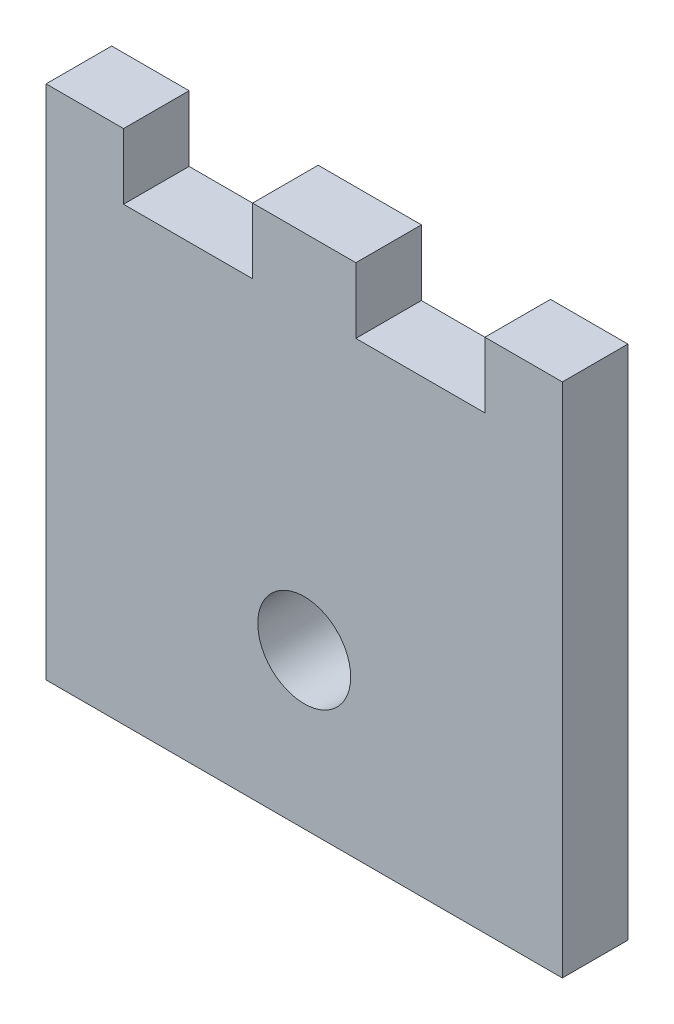
ISO-10303-21;
HEADER;
FILE_DESCRIPTION(('STEP AP214'),'2;1');
FILE_NAME('part.step','',(''),(''),'','','');
FILE_SCHEMA(('AUTOMOTIVE_DESIGN { 1 0 10303 214 1 1 1 1 }'));
ENDSEC;
DATA;
#1=APPLICATION_CONTEXT('core data for automotive mechanical design processes');
#2=APPLICATION_PROTOCOL_DEFINITION('international standard','automotive_design',2000,#1);
#3=PRODUCT_CONTEXT('',#1,'mechanical');
#4=PRODUCT('Part','Part','',(#3));
#5=PRODUCT_RELATED_PRODUCT_CATEGORY('part','',(#4));
#6=PRODUCT_DEFINITION_FORMATION('','',#4);
#7=PRODUCT_DEFINITION_CONTEXT('part definition',#1,'design');
#8=PRODUCT_DEFINITION('design','',#6,#7);
#9=PRODUCT_DEFINITION_SHAPE('','',#8);
#10=(LENGTH_UNIT() NAMED_UNIT(*) SI_UNIT(.MILLI.,.METRE.));
#11=(NAMED_UNIT(*) PLANE_ANGLE_UNIT() SI_UNIT($,.RADIAN.));
#12=(NAMED_UNIT(*) SI_UNIT($,.STERADIAN.) SOLID_ANGLE_UNIT());
#13=UNCERTAINTY_MEASURE_WITH_UNIT(LENGTH_MEASURE(1.E-05),#10,'distance_accuracy_value','');
#14=(GEOMETRIC_REPRESENTATION_CONTEXT(3) GLOBAL_UNCERTAINTY_ASSIGNED_CONTEXT((#13)) GLOBAL_UNIT_ASSIGNED_CONTEXT((#10,
#11,#12)) REPRESENTATION_CONTEXT('',''));
#15=CARTESIAN_POINT('',(0.,0.,0.));
#16=DIRECTION('',(0.,0.,1.));
#17=DIRECTION('',(1.,0.,0.));
#18=AXIS2_PLACEMENT_3D('',#15,#16,#17);
#19=CARTESIAN_POINT('',(0.,50.,6.35));
#20=DIRECTION('',(0.,-1.,0.));
#21=DIRECTION('',(0.,0.,-1.));
#22=AXIS2_PLACEMENT_3D('',#19,#20,#21);
#23=PLANE('',#22);
#24=DIRECTION('',(-1.,0.,0.));
#25=VECTOR('',#24,1.);
#26=CARTESIAN_POINT('',(0.,50.,6.35));
#27=LINE('',#26,#25);
#28=CARTESIAN_POINT('',(7.5,50.,6.35));
#29=VERTEX_POINT('',#28);
#30=CARTESIAN_POINT('',(0.,50.,6.35));
#31=VERTEX_POINT('',#30);
#32=EDGE_CURVE('E229',#29,#31,#27,.T.);
#33=ORIENTED_EDGE('',*,*,#32,.F.);
#34=DIRECTION('',(0.,0.,1.));
#35=VECTOR('',#34,1.);
#36=CARTESIAN_POINT('',(7.5,50.,0.));
#37=LINE('',#36,#35);
#38=CARTESIAN_POINT('',(7.5,50.,0.));
#39=VERTEX_POINT('',#38);
#40=EDGE_CURVE('E167',#39,#29,#37,.T.);
#41=ORIENTED_EDGE('',*,*,#40,.F.);
#42=DIRECTION('',(-1.,0.,0.));
#43=VECTOR('',#42,1.);
#44=CARTESIAN_POINT('',(0.,50.,0.));
#45=LINE('',#44,#43);
#46=CARTESIAN_POINT('',(0.,50.,0.));
#47=VERTEX_POINT('',#46);
#48=EDGE_CURVE('E152',#39,#47,#45,.T.);
#49=ORIENTED_EDGE('',*,*,#48,.T.);
#50=DIRECTION('',(0.,0.,-1.));
#51=VECTOR('',#50,1.);
#52=CARTESIAN_POINT('',(0.,50.,6.35));
#53=LINE('',#52,#51);
#54=EDGE_CURVE('E234',#31,#47,#53,.T.);
#55=ORIENTED_EDGE('',*,*,#54,.F.);
#56=EDGE_LOOP('',(#33,#41,#49,#55));
#57=FACE_BOUND('',#56,.T.);
#58=ADVANCED_FACE('F39',(#57),#23,.F.);
#59=CARTESIAN_POINT('',(30.,50.,0.));
#60=VERTEX_POINT('',#59);
#61=CARTESIAN_POINT('',(20.,50.,0.));
#62=VERTEX_POINT('',#61);
#63=EDGE_CURVE('E248',#60,#62,#45,.T.);
#64=ORIENTED_EDGE('',*,*,#63,.T.);
#65=DIRECTION('',(0.,0.,1.));
#66=VECTOR('',#65,1.);
#67=CARTESIAN_POINT('',(20.,50.,0.));
#68=LINE('',#67,#66);
#69=CARTESIAN_POINT('',(20.,50.,6.35));
#70=VERTEX_POINT('',#69);
#71=EDGE_CURVE('E171',#62,#70,#68,.T.);
#72=ORIENTED_EDGE('',*,*,#71,.T.);
#73=CARTESIAN_POINT('',(30.,50.,6.35));
#74=VERTEX_POINT('',#73);
#75=EDGE_CURVE('E235',#74,#70,#27,.T.);
#76=ORIENTED_EDGE('',*,*,#75,.F.);
#77=DIRECTION('',(0.,0.,1.));
#78=VECTOR('',#77,1.);
#79=CARTESIAN_POINT('',(30.,50.,0.));
#80=LINE('',#79,#78);
#81=EDGE_CURVE('E164',#60,#74,#80,.T.);
#82=ORIENTED_EDGE('',*,*,#81,.F.);
#83=EDGE_LOOP('',(#64,#72,#76,#82));
#84=FACE_BOUND('',#83,.T.);
#85=ADVANCED_FACE('F285',(#84),#23,.F.);
#86=CARTESIAN_POINT('',(0.,0.,6.35));
#87=DIRECTION('',(1.,0.,0.));
#88=DIRECTION('',(0.,0.,-1.));
#89=AXIS2_PLACEMENT_3D('',#86,#87,#88);
#90=PLANE('',#89);
#91=DIRECTION('',(0.,-1.,0.));
#92=VECTOR('',#91,1.);
#93=CARTESIAN_POINT('',(0.,0.,0.));
#94=LINE('',#93,#92);
#95=CARTESIAN_POINT('',(0.,0.,0.));
#96=VERTEX_POINT('',#95);
#97=EDGE_CURVE('E170',#47,#96,#94,.T.);
#98=ORIENTED_EDGE('',*,*,#97,.T.);
#99=DIRECTION('',(0.,0.,-1.));
#100=VECTOR('',#99,1.);
#101=CARTESIAN_POINT('',(0.,0.,6.35));
#102=LINE('',#101,#100);
#103=CARTESIAN_POINT('',(0.,0.,6.35));
#104=VERTEX_POINT('',#103);
#105=EDGE_CURVE('E11',#104,#96,#102,.T.);
#106=ORIENTED_EDGE('',*,*,#105,.F.);
#107=DIRECTION('',(0.,-1.,0.));
#108=VECTOR('',#107,1.);
#109=CARTESIAN_POINT('',(0.,0.,6.35));
#110=LINE('',#109,#108);
#111=EDGE_CURVE('E218',#31,#104,#110,.T.);
#112=ORIENTED_EDGE('',*,*,#111,.F.);
#113=ORIENTED_EDGE('',*,*,#54,.T.);
#114=EDGE_LOOP('',(#98,#106,#112,#113));
#115=FACE_BOUND('',#114,.T.);
#116=ADVANCED_FACE('F41',(#115),#90,.F.);
#117=CARTESIAN_POINT('',(0.,0.,6.35));
#118=DIRECTION('',(0.,1.,0.));
#119=DIRECTION('',(0.,0.,1.));
#120=AXIS2_PLACEMENT_3D('',#117,#118,#119);
#121=PLANE('',#120);
#122=DIRECTION('',(1.,0.,0.));
#123=VECTOR('',#122,1.);
#124=CARTESIAN_POINT('',(0.,0.,0.));
#125=LINE('',#124,#123);
#126=CARTESIAN_POINT('',(50.,0.,0.));
#127=VERTEX_POINT('',#126);
#128=EDGE_CURVE('E239',#96,#127,#125,.T.);
#129=ORIENTED_EDGE('',*,*,#128,.T.);
#130=DIRECTION('',(0.,0.,-1.));
#131=VECTOR('',#130,1.);
#132=CARTESIAN_POINT('',(50.,0.,6.35));
#133=LINE('',#132,#131);
#134=CARTESIAN_POINT('',(50.,0.,6.35));
#135=VERTEX_POINT('',#134);
#136=EDGE_CURVE('E48',#135,#127,#133,.T.);
#137=ORIENTED_EDGE('',*,*,#136,.F.);
#138=DIRECTION('',(1.,0.,0.));
#139=VECTOR('',#138,1.);
#140=CARTESIAN_POINT('',(0.,0.,6.35));
#141=LINE('',#140,#139);
#142=EDGE_CURVE('E222',#104,#135,#141,.T.);
#143=ORIENTED_EDGE('',*,*,#142,.F.);
#144=ORIENTED_EDGE('',*,*,#105,.T.);
#145=EDGE_LOOP('',(#129,#137,#143,#144));
#146=FACE_BOUND('',#145,.T.);
#147=ADVANCED_FACE('F274',(#146),#121,.F.);
#148=CARTESIAN_POINT('',(50.,0.,6.35));
#149=DIRECTION('',(-1.,0.,0.));
#150=DIRECTION('',(0.,0.,1.));
#151=AXIS2_PLACEMENT_3D('',#148,#149,#150);
#152=PLANE('',#151);
#153=DIRECTION('',(0.,1.,0.));
#154=VECTOR('',#153,1.);
#155=CARTESIAN_POINT('',(50.,0.,0.));
#156=LINE('',#155,#154);
#157=CARTESIAN_POINT('',(50.,50.,0.));
#158=VERTEX_POINT('',#157);
#159=EDGE_CURVE('E242',#127,#158,#156,.T.);
#160=ORIENTED_EDGE('',*,*,#159,.T.);
#161=DIRECTION('',(0.,0.,-1.));
#162=VECTOR('',#161,1.);
#163=CARTESIAN_POINT('',(50.,50.,6.35));
#164=LINE('',#163,#162);
#165=CARTESIAN_POINT('',(50.,50.,6.35));
#166=VERTEX_POINT('',#165);
#167=EDGE_CURVE('E252',#166,#158,#164,.T.);
#168=ORIENTED_EDGE('',*,*,#167,.F.);
#169=DIRECTION('',(0.,1.,0.));
#170=VECTOR('',#169,1.);
#171=CARTESIAN_POINT('',(50.,0.,6.35));
#172=LINE('',#171,#170);
#173=EDGE_CURVE('E226',#135,#166,#172,.T.);
#174=ORIENTED_EDGE('',*,*,#173,.F.);
#175=ORIENTED_EDGE('',*,*,#136,.T.);
#176=EDGE_LOOP('',(#160,#168,#174,#175));
#177=FACE_BOUND('',#176,.T.);
#178=ADVANCED_FACE('F261',(#177),#152,.F.);
#179=CARTESIAN_POINT('',(42.5,50.,0.));
#180=VERTEX_POINT('',#179);
#181=EDGE_CURVE('E223',#158,#180,#45,.T.);
#182=ORIENTED_EDGE('',*,*,#181,.T.);
#183=DIRECTION('',(0.,0.,1.));
#184=VECTOR('',#183,1.);
#185=CARTESIAN_POINT('',(42.5,50.,0.));
#186=LINE('',#185,#184);
#187=CARTESIAN_POINT('',(42.5,50.,6.35));
#188=VERTEX_POINT('',#187);
#189=EDGE_CURVE('E202',#180,#188,#186,.T.);
#190=ORIENTED_EDGE('',*,*,#189,.T.);
#191=EDGE_CURVE('E230',#166,#188,#27,.T.);
#192=ORIENTED_EDGE('',*,*,#191,.F.);
#193=ORIENTED_EDGE('',*,*,#167,.T.);
#194=EDGE_LOOP('',(#182,#190,#192,#193));
#195=FACE_BOUND('',#194,.T.);
#196=ADVANCED_FACE('F266',(#195),#23,.F.);
#197=CARTESIAN_POINT('',(0.,0.,6.35));
#198=DIRECTION('',(0.,0.,-1.));
#199=DIRECTION('',(-1.,0.,0.));
#200=AXIS2_PLACEMENT_3D('',#197,#198,#199);
#201=PLANE('',#200);
#202=CARTESIAN_POINT('',(25.,15.,6.35));
#203=DIRECTION('',(0.,0.,1.));
#204=DIRECTION('',(1.,0.,0.));
#205=AXIS2_PLACEMENT_3D('',#202,#203,#204);
#206=CIRCLE('',#205,4.5);
#207=CARTESIAN_POINT('',(29.5,15.,6.35));
#208=VERTEX_POINT('',#207);
#209=EDGE_CURVE('E214',#208,#208,#206,.T.);
#210=ORIENTED_EDGE('',*,*,#209,.F.);
#211=EDGE_LOOP('',(#210));
#212=FACE_BOUND('',#211,.T.);
#213=DIRECTION('',(1.,0.,0.));
#214=VECTOR('',#213,1.);
#215=CARTESIAN_POINT('',(7.5,43.65,6.35));
#216=LINE('',#215,#214);
#217=CARTESIAN_POINT('',(7.5,43.65,6.35));
#218=VERTEX_POINT('',#217);
#219=CARTESIAN_POINT('',(20.,43.65,6.35));
#220=VERTEX_POINT('',#219);
#221=EDGE_CURVE('E157',#218,#220,#216,.T.);
#222=ORIENTED_EDGE('',*,*,#221,.F.);
#223=DIRECTION('',(0.,-1.,0.));
#224=VECTOR('',#223,1.);
#225=CARTESIAN_POINT('',(7.5,50.,6.35));
#226=LINE('',#225,#224);
#227=EDGE_CURVE('E135',#29,#218,#226,.T.);
#228=ORIENTED_EDGE('',*,*,#227,.F.);
#229=ORIENTED_EDGE('',*,*,#32,.T.);
#230=ORIENTED_EDGE('',*,*,#111,.T.);
#231=ORIENTED_EDGE('',*,*,#142,.T.);
#232=ORIENTED_EDGE('',*,*,#173,.T.);
#233=ORIENTED_EDGE('',*,*,#191,.T.);
#234=DIRECTION('',(0.,1.,0.));
#235=VECTOR('',#234,1.);
#236=CARTESIAN_POINT('',(42.5,50.,6.35));
#237=LINE('',#236,#235);
#238=CARTESIAN_POINT('',(42.5,43.65,6.35));
#239=VERTEX_POINT('',#238);
#240=EDGE_CURVE('E182',#239,#188,#237,.T.);
#241=ORIENTED_EDGE('',*,*,#240,.F.);
#242=DIRECTION('',(1.,0.,0.));
#243=VECTOR('',#242,1.);
#244=CARTESIAN_POINT('',(30.,43.65,6.35));
#245=LINE('',#244,#243);
#246=CARTESIAN_POINT('',(30.,43.65,6.35));
#247=VERTEX_POINT('',#246);
#248=EDGE_CURVE('E193',#247,#239,#245,.T.);
#249=ORIENTED_EDGE('',*,*,#248,.F.);
#250=DIRECTION('',(0.,-1.,0.));
#251=VECTOR('',#250,1.);
#252=CARTESIAN_POINT('',(30.,50.,6.35));
#253=LINE('',#252,#251);
#254=EDGE_CURVE('E189',#74,#247,#253,.T.);
#255=ORIENTED_EDGE('',*,*,#254,.F.);
#256=ORIENTED_EDGE('',*,*,#75,.T.);
#257=DIRECTION('',(0.,1.,0.));
#258=VECTOR('',#257,1.);
#259=CARTESIAN_POINT('',(20.,50.,6.35));
#260=LINE('',#259,#258);
#261=EDGE_CURVE('E154',#220,#70,#260,.T.);
#262=ORIENTED_EDGE('',*,*,#261,.F.);
#263=EDGE_LOOP('',(#222,#228,#229,#230,#231,#232,#233,#241,#249,#255,#256,#262));
#264=FACE_BOUND('',#263,.T.);
#265=ADVANCED_FACE('F270',(#212,#264),#201,.F.);
#266=CARTESIAN_POINT('',(0.,0.,0.));
#267=DIRECTION('',(0.,0.,-1.));
#268=DIRECTION('',(-1.,0.,0.));
#269=AXIS2_PLACEMENT_3D('',#266,#267,#268);
#270=PLANE('',#269);
#271=DIRECTION('',(0.,-1.,0.));
#272=VECTOR('',#271,1.);
#273=CARTESIAN_POINT('',(7.5,50.,0.));
#274=LINE('',#273,#272);
#275=CARTESIAN_POINT('',(7.5,43.65,0.));
#276=VERTEX_POINT('',#275);
#277=EDGE_CURVE('E132',#39,#276,#274,.T.);
#278=ORIENTED_EDGE('',*,*,#277,.T.);
#279=DIRECTION('',(1.,0.,0.));
#280=VECTOR('',#279,1.);
#281=CARTESIAN_POINT('',(7.5,43.65,0.));
#282=LINE('',#281,#280);
#283=CARTESIAN_POINT('',(20.,43.65,0.));
#284=VERTEX_POINT('',#283);
#285=EDGE_CURVE('E143',#276,#284,#282,.T.);
#286=ORIENTED_EDGE('',*,*,#285,.T.);
#287=DIRECTION('',(0.,1.,0.));
#288=VECTOR('',#287,1.);
#289=CARTESIAN_POINT('',(20.,50.,0.));
#290=LINE('',#289,#288);
#291=EDGE_CURVE('E55',#284,#62,#290,.T.);
#292=ORIENTED_EDGE('',*,*,#291,.T.);
#293=ORIENTED_EDGE('',*,*,#63,.F.);
#294=DIRECTION('',(0.,-1.,0.));
#295=VECTOR('',#294,1.);
#296=CARTESIAN_POINT('',(30.,50.,0.));
#297=LINE('',#296,#295);
#298=CARTESIAN_POINT('',(30.,43.65,0.));
#299=VERTEX_POINT('',#298);
#300=EDGE_CURVE('E177',#60,#299,#297,.T.);
#301=ORIENTED_EDGE('',*,*,#300,.T.);
#302=DIRECTION('',(1.,0.,0.));
#303=VECTOR('',#302,1.);
#304=CARTESIAN_POINT('',(30.,43.65,0.));
#305=LINE('',#304,#303);
#306=CARTESIAN_POINT('',(42.5,43.65,0.));
#307=VERTEX_POINT('',#306);
#308=EDGE_CURVE('E181',#299,#307,#305,.T.);
#309=ORIENTED_EDGE('',*,*,#308,.T.);
#310=DIRECTION('',(0.,1.,0.));
#311=VECTOR('',#310,1.);
#312=CARTESIAN_POINT('',(42.5,50.,0.));
#313=LINE('',#312,#311);
#314=EDGE_CURVE('E63',#307,#180,#313,.T.);
#315=ORIENTED_EDGE('',*,*,#314,.T.);
#316=ORIENTED_EDGE('',*,*,#181,.F.);
#317=ORIENTED_EDGE('',*,*,#159,.F.);
#318=ORIENTED_EDGE('',*,*,#128,.F.);
#319=ORIENTED_EDGE('',*,*,#97,.F.);
#320=ORIENTED_EDGE('',*,*,#48,.F.);
#321=EDGE_LOOP('',(#278,#286,#292,#293,#301,#309,#315,#316,#317,#318,#319,#320));
#322=FACE_BOUND('',#321,.T.);
#323=CARTESIAN_POINT('',(25.,15.,0.));
#324=DIRECTION('',(0.,0.,1.));
#325=DIRECTION('',(1.,0.,0.));
#326=AXIS2_PLACEMENT_3D('',#323,#324,#325);
#327=CIRCLE('',#326,4.5);
#328=CARTESIAN_POINT('',(29.5,15.,0.));
#329=VERTEX_POINT('',#328);
#330=EDGE_CURVE('E194',#329,#329,#327,.T.);
#331=ORIENTED_EDGE('',*,*,#330,.T.);
#332=EDGE_LOOP('',(#331));
#333=FACE_BOUND('',#332,.T.);
#334=ADVANCED_FACE('F149',(#322,#333),#270,.T.);
#335=CARTESIAN_POINT('',(25.,15.,0.));
#336=DIRECTION('',(0.,0.,1.));
#337=DIRECTION('',(1.,0.,0.));
#338=AXIS2_PLACEMENT_3D('',#335,#336,#337);
#339=CYLINDRICAL_SURFACE('',#338,4.5);
#340=ORIENTED_EDGE('',*,*,#330,.F.);
#341=EDGE_LOOP('',(#340));
#342=FACE_BOUND('',#341,.T.);
#343=ORIENTED_EDGE('',*,*,#209,.T.);
#344=EDGE_LOOP('',(#343));
#345=FACE_BOUND('',#344,.T.);
#346=ADVANCED_FACE('F302',(#342,#345),#339,.F.);
#347=CARTESIAN_POINT('',(30.,50.,0.));
#348=DIRECTION('',(-1.,0.,0.));
#349=DIRECTION('',(0.,0.,1.));
#350=AXIS2_PLACEMENT_3D('',#347,#348,#349);
#351=PLANE('',#350);
#352=ORIENTED_EDGE('',*,*,#254,.T.);
#353=DIRECTION('',(0.,0.,1.));
#354=VECTOR('',#353,1.);
#355=CARTESIAN_POINT('',(30.,43.65,0.));
#356=LINE('',#355,#354);
#357=EDGE_CURVE('E188',#299,#247,#356,.T.);
#358=ORIENTED_EDGE('',*,*,#357,.F.);
#359=ORIENTED_EDGE('',*,*,#300,.F.);
#360=ORIENTED_EDGE('',*,*,#81,.T.);
#361=EDGE_LOOP('',(#352,#358,#359,#360));
#362=FACE_BOUND('',#361,.T.);
#363=ADVANCED_FACE('F290',(#362),#351,.F.);
#364=CARTESIAN_POINT('',(42.5,50.,0.));
#365=DIRECTION('',(1.,0.,0.));
#366=DIRECTION('',(0.,0.,-1.));
#367=AXIS2_PLACEMENT_3D('',#364,#365,#366);
#368=PLANE('',#367);
#369=ORIENTED_EDGE('',*,*,#240,.T.);
#370=ORIENTED_EDGE('',*,*,#189,.F.);
#371=ORIENTED_EDGE('',*,*,#314,.F.);
#372=DIRECTION('',(0.,0.,1.));
#373=VECTOR('',#372,1.);
#374=CARTESIAN_POINT('',(42.5,43.65,0.));
#375=LINE('',#374,#373);
#376=EDGE_CURVE('E206',#307,#239,#375,.T.);
#377=ORIENTED_EDGE('',*,*,#376,.T.);
#378=EDGE_LOOP('',(#369,#370,#371,#377));
#379=FACE_BOUND('',#378,.T.);
#380=ADVANCED_FACE('F294',(#379),#368,.F.);
#381=CARTESIAN_POINT('',(30.,43.65,0.));
#382=DIRECTION('',(0.,-1.,0.));
#383=DIRECTION('',(0.,0.,-1.));
#384=AXIS2_PLACEMENT_3D('',#381,#382,#383);
#385=PLANE('',#384);
#386=ORIENTED_EDGE('',*,*,#248,.T.);
#387=ORIENTED_EDGE('',*,*,#376,.F.);
#388=ORIENTED_EDGE('',*,*,#308,.F.);
#389=ORIENTED_EDGE('',*,*,#357,.T.);
#390=EDGE_LOOP('',(#386,#387,#388,#389));
#391=FACE_BOUND('',#390,.T.);
#392=ADVANCED_FACE('F293',(#391),#385,.F.);
#393=CARTESIAN_POINT('',(7.5,50.,0.));
#394=DIRECTION('',(-1.,0.,0.));
#395=DIRECTION('',(0.,-1.,0.));
#396=AXIS2_PLACEMENT_3D('',#393,#394,#395);
#397=PLANE('',#396);
#398=ORIENTED_EDGE('',*,*,#227,.T.);
#399=DIRECTION('',(0.,0.,1.));
#400=VECTOR('',#399,1.);
#401=CARTESIAN_POINT('',(7.5,43.65,0.));
#402=LINE('',#401,#400);
#403=EDGE_CURVE('E128',#276,#218,#402,.T.);
#404=ORIENTED_EDGE('',*,*,#403,.F.);
#405=ORIENTED_EDGE('',*,*,#277,.F.);
#406=ORIENTED_EDGE('',*,*,#40,.T.);
#407=EDGE_LOOP('',(#398,#404,#405,#406));
#408=FACE_BOUND('',#407,.T.);
#409=ADVANCED_FACE('F130',(#408),#397,.F.);
#410=CARTESIAN_POINT('',(20.,50.,0.));
#411=DIRECTION('',(1.,0.,0.));
#412=DIRECTION('',(0.,0.,-1.));
#413=AXIS2_PLACEMENT_3D('',#410,#411,#412);
#414=PLANE('',#413);
#415=ORIENTED_EDGE('',*,*,#261,.T.);
#416=ORIENTED_EDGE('',*,*,#71,.F.);
#417=ORIENTED_EDGE('',*,*,#291,.F.);
#418=DIRECTION('',(0.,0.,1.));
#419=VECTOR('',#418,1.);
#420=CARTESIAN_POINT('',(20.,43.65,0.));
#421=LINE('',#420,#419);
#422=EDGE_CURVE('E140',#284,#220,#421,.T.);
#423=ORIENTED_EDGE('',*,*,#422,.T.);
#424=EDGE_LOOP('',(#415,#416,#417,#423));
#425=FACE_BOUND('',#424,.T.);
#426=ADVANCED_FACE('F385',(#425),#414,.F.);
#427=CARTESIAN_POINT('',(7.5,43.65,0.));
#428=DIRECTION('',(0.,-1.,0.));
#429=DIRECTION('',(0.,0.,-1.));
#430=AXIS2_PLACEMENT_3D('',#427,#428,#429);
#431=PLANE('',#430);
#432=ORIENTED_EDGE('',*,*,#221,.T.);
#433=ORIENTED_EDGE('',*,*,#422,.F.);
#434=ORIENTED_EDGE('',*,*,#285,.F.);
#435=ORIENTED_EDGE('',*,*,#403,.T.);
#436=EDGE_LOOP('',(#432,#433,#434,#435));
#437=FACE_BOUND('',#436,.T.);
#438=ADVANCED_FACE('F144',(#437),#431,.F.);
#439=CLOSED_SHELL('',(#58,#85,#116,#147,#178,#196,#265,#334,#346,#363,#380,#392,#409,#426,#438));
#440=MANIFOLD_SOLID_BREP('B2',#439);
#441=ADVANCED_BREP_SHAPE_REPRESENTATION('',(#18,#440),#14);
#442=SHAPE_DEFINITION_REPRESENTATION(#9,#441);
ENDSEC;
END-ISO-10303-21;
